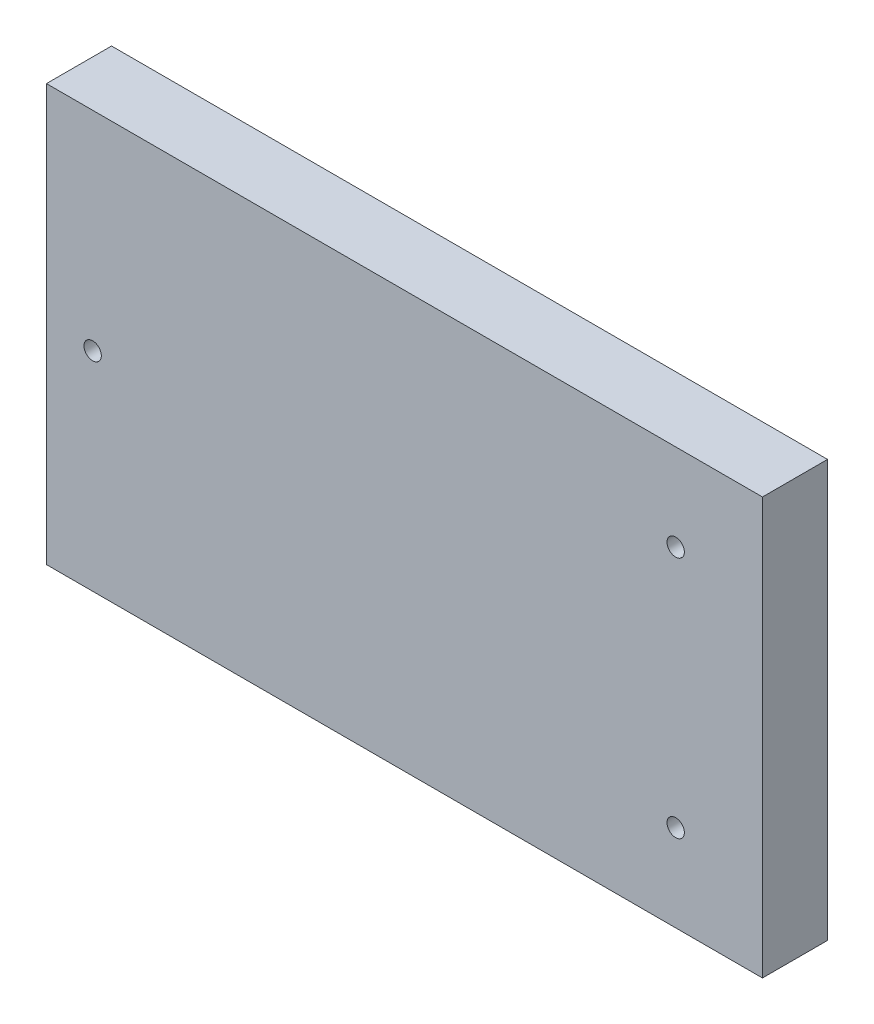
ISO-10303-21;
HEADER;
FILE_DESCRIPTION(('STEP AP214'),'2;1');
FILE_NAME('part.step','',(''),(''),'','','');
FILE_SCHEMA(('AUTOMOTIVE_DESIGN { 1 0 10303 214 1 1 1 1 }'));
ENDSEC;
DATA;
#1=APPLICATION_CONTEXT('core data for automotive mechanical design processes');
#2=APPLICATION_PROTOCOL_DEFINITION('international standard','automotive_design',2000,#1);
#3=PRODUCT_CONTEXT('',#1,'mechanical');
#4=PRODUCT('Part','Part','',(#3));
#5=PRODUCT_RELATED_PRODUCT_CATEGORY('part','',(#4));
#6=PRODUCT_DEFINITION_FORMATION('','',#4);
#7=PRODUCT_DEFINITION_CONTEXT('part definition',#1,'design');
#8=PRODUCT_DEFINITION('design','',#6,#7);
#9=PRODUCT_DEFINITION_SHAPE('','',#8);
#10=(LENGTH_UNIT() NAMED_UNIT(*) SI_UNIT(.MILLI.,.METRE.));
#11=(NAMED_UNIT(*) PLANE_ANGLE_UNIT() SI_UNIT($,.RADIAN.));
#12=(NAMED_UNIT(*) SI_UNIT($,.STERADIAN.) SOLID_ANGLE_UNIT());
#13=UNCERTAINTY_MEASURE_WITH_UNIT(LENGTH_MEASURE(1.E-05),#10,'distance_accuracy_value','');
#14=(GEOMETRIC_REPRESENTATION_CONTEXT(3) GLOBAL_UNCERTAINTY_ASSIGNED_CONTEXT((#13)) GLOBAL_UNIT_ASSIGNED_CONTEXT((#10,
#11,#12)) REPRESENTATION_CONTEXT('',''));
#15=CARTESIAN_POINT('',(0.,0.,0.));
#16=DIRECTION('',(0.,0.,1.));
#17=DIRECTION('',(1.,0.,0.));
#18=AXIS2_PLACEMENT_3D('',#15,#16,#17);
#19=CARTESIAN_POINT('',(0.,0.,15.));
#20=DIRECTION('',(0.,0.,-1.));
#21=DIRECTION('',(-1.,0.,0.));
#22=AXIS2_PLACEMENT_3D('',#19,#20,#21);
#23=PLANE('',#22);
#24=DIRECTION('',(0.,1.,0.));
#25=VECTOR('',#24,1.);
#26=CARTESIAN_POINT('',(705.534520474604,316.509389187344,15.));
#27=LINE('',#26,#25);
#28=CARTESIAN_POINT('',(705.534520474604,220.509389187344,15.));
#29=VERTEX_POINT('',#28);
#30=CARTESIAN_POINT('',(705.534520474604,316.509389187344,15.));
#31=VERTEX_POINT('',#30);
#32=EDGE_CURVE('E84',#29,#31,#27,.T.);
#33=ORIENTED_EDGE('',*,*,#32,.T.);
#34=DIRECTION('',(-1.,0.,0.));
#35=VECTOR('',#34,1.);
#36=CARTESIAN_POINT('',(705.534520474604,316.509389187344,15.));
#37=LINE('',#36,#35);
#38=CARTESIAN_POINT('',(540.534520474604,316.509389187344,15.));
#39=VERTEX_POINT('',#38);
#40=EDGE_CURVE('E79',#31,#39,#37,.T.);
#41=ORIENTED_EDGE('',*,*,#40,.T.);
#42=DIRECTION('',(0.,-1.,0.));
#43=VECTOR('',#42,1.);
#44=CARTESIAN_POINT('',(540.534520474604,316.509389187344,15.));
#45=LINE('',#44,#43);
#46=CARTESIAN_POINT('',(540.534520474604,220.509389187344,15.));
#47=VERTEX_POINT('',#46);
#48=EDGE_CURVE('E82',#39,#47,#45,.T.);
#49=ORIENTED_EDGE('',*,*,#48,.T.);
#50=DIRECTION('',(1.,0.,0.));
#51=VECTOR('',#50,1.);
#52=CARTESIAN_POINT('',(705.534520474604,220.509389187344,15.));
#53=LINE('',#52,#51);
#54=EDGE_CURVE('E49',#47,#29,#53,.T.);
#55=ORIENTED_EDGE('',*,*,#54,.T.);
#56=EDGE_LOOP('',(#33,#41,#49,#55));
#57=FACE_BOUND('',#56,.T.);
#58=CARTESIAN_POINT('',(685.534520474604,296.509389187344,15.));
#59=DIRECTION('',(0.,0.,1.));
#60=DIRECTION('',(1.,0.,0.));
#61=AXIS2_PLACEMENT_3D('',#58,#59,#60);
#62=CIRCLE('',#61,2.);
#63=CARTESIAN_POINT('',(687.534520474604,296.509389187344,15.));
#64=VERTEX_POINT('',#63);
#65=EDGE_CURVE('E99',#64,#64,#62,.T.);
#66=ORIENTED_EDGE('',*,*,#65,.F.);
#67=EDGE_LOOP('',(#66));
#68=FACE_BOUND('',#67,.T.);
#69=CARTESIAN_POINT('',(685.534520474604,240.509389187344,15.));
#70=DIRECTION('',(0.,0.,1.));
#71=DIRECTION('',(1.,0.,0.));
#72=AXIS2_PLACEMENT_3D('',#69,#70,#71);
#73=CIRCLE('',#72,2.);
#74=CARTESIAN_POINT('',(687.534520474604,240.509389187344,15.));
#75=VERTEX_POINT('',#74);
#76=EDGE_CURVE('E114',#75,#75,#73,.T.);
#77=ORIENTED_EDGE('',*,*,#76,.F.);
#78=EDGE_LOOP('',(#77));
#79=FACE_BOUND('',#78,.T.);
#80=CARTESIAN_POINT('',(551.18363111528,268.509389187344,15.));
#81=DIRECTION('',(0.,0.,1.));
#82=DIRECTION('',(1.,0.,0.));
#83=AXIS2_PLACEMENT_3D('',#80,#81,#82);
#84=CIRCLE('',#83,2.);
#85=CARTESIAN_POINT('',(553.18363111528,268.509389187344,15.));
#86=VERTEX_POINT('',#85);
#87=EDGE_CURVE('E120',#86,#86,#84,.T.);
#88=ORIENTED_EDGE('',*,*,#87,.F.);
#89=EDGE_LOOP('',(#88));
#90=FACE_BOUND('',#89,.T.);
#91=ADVANCED_FACE('F32',(#57,#68,#79,#90),#23,.F.);
#92=CARTESIAN_POINT('',(0.,0.,0.));
#93=DIRECTION('',(0.,0.,-1.));
#94=DIRECTION('',(-1.,0.,0.));
#95=AXIS2_PLACEMENT_3D('',#92,#93,#94);
#96=PLANE('',#95);
#97=CARTESIAN_POINT('',(685.534520474604,240.509389187344,0.));
#98=DIRECTION('',(0.,0.,1.));
#99=DIRECTION('',(1.,0.,0.));
#100=AXIS2_PLACEMENT_3D('',#97,#98,#99);
#101=CIRCLE('',#100,2.);
#102=CARTESIAN_POINT('',(687.534520474604,240.509389187344,0.));
#103=VERTEX_POINT('',#102);
#104=EDGE_CURVE('E117',#103,#103,#101,.T.);
#105=ORIENTED_EDGE('',*,*,#104,.T.);
#106=EDGE_LOOP('',(#105));
#107=FACE_BOUND('',#106,.T.);
#108=DIRECTION('',(0.,1.,0.));
#109=VECTOR('',#108,1.);
#110=CARTESIAN_POINT('',(705.534520474604,316.509389187344,0.));
#111=LINE('',#110,#109);
#112=CARTESIAN_POINT('',(705.534520474604,220.509389187344,0.));
#113=VERTEX_POINT('',#112);
#114=CARTESIAN_POINT('',(705.534520474604,316.509389187344,0.));
#115=VERTEX_POINT('',#114);
#116=EDGE_CURVE('E96',#113,#115,#111,.T.);
#117=ORIENTED_EDGE('',*,*,#116,.F.);
#118=DIRECTION('',(1.,0.,0.));
#119=VECTOR('',#118,1.);
#120=CARTESIAN_POINT('',(705.534520474604,220.509389187344,0.));
#121=LINE('',#120,#119);
#122=CARTESIAN_POINT('',(540.534520474604,220.509389187344,0.));
#123=VERTEX_POINT('',#122);
#124=EDGE_CURVE('E72',#123,#113,#121,.T.);
#125=ORIENTED_EDGE('',*,*,#124,.F.);
#126=DIRECTION('',(0.,-1.,0.));
#127=VECTOR('',#126,1.);
#128=CARTESIAN_POINT('',(540.534520474604,316.509389187344,0.));
#129=LINE('',#128,#127);
#130=CARTESIAN_POINT('',(540.534520474604,316.509389187344,0.));
#131=VERTEX_POINT('',#130);
#132=EDGE_CURVE('E66',#131,#123,#129,.T.);
#133=ORIENTED_EDGE('',*,*,#132,.F.);
#134=DIRECTION('',(-1.,0.,0.));
#135=VECTOR('',#134,1.);
#136=CARTESIAN_POINT('',(705.534520474604,316.509389187344,0.));
#137=LINE('',#136,#135);
#138=EDGE_CURVE('E88',#115,#131,#137,.T.);
#139=ORIENTED_EDGE('',*,*,#138,.F.);
#140=EDGE_LOOP('',(#117,#125,#133,#139));
#141=FACE_BOUND('',#140,.T.);
#142=CARTESIAN_POINT('',(685.534520474604,296.509389187344,0.));
#143=DIRECTION('',(0.,0.,1.));
#144=DIRECTION('',(1.,0.,0.));
#145=AXIS2_PLACEMENT_3D('',#142,#143,#144);
#146=CIRCLE('',#145,2.);
#147=CARTESIAN_POINT('',(687.534520474604,296.509389187344,0.));
#148=VERTEX_POINT('',#147);
#149=EDGE_CURVE('E111',#148,#148,#146,.T.);
#150=ORIENTED_EDGE('',*,*,#149,.T.);
#151=EDGE_LOOP('',(#150));
#152=FACE_BOUND('',#151,.T.);
#153=CARTESIAN_POINT('',(551.18363111528,268.509389187344,0.));
#154=DIRECTION('',(0.,0.,1.));
#155=DIRECTION('',(1.,0.,0.));
#156=AXIS2_PLACEMENT_3D('',#153,#154,#155);
#157=CIRCLE('',#156,2.);
#158=CARTESIAN_POINT('',(553.18363111528,268.509389187344,0.));
#159=VERTEX_POINT('',#158);
#160=EDGE_CURVE('E123',#159,#159,#157,.T.);
#161=ORIENTED_EDGE('',*,*,#160,.T.);
#162=EDGE_LOOP('',(#161));
#163=FACE_BOUND('',#162,.T.);
#164=ADVANCED_FACE('F107',(#107,#141,#152,#163),#96,.T.);
#165=CARTESIAN_POINT('',(705.534520474604,316.509389187344,15.));
#166=DIRECTION('',(-1.,0.,0.));
#167=DIRECTION('',(0.,0.,1.));
#168=AXIS2_PLACEMENT_3D('',#165,#166,#167);
#169=PLANE('',#168);
#170=ORIENTED_EDGE('',*,*,#116,.T.);
#171=DIRECTION('',(0.,0.,-1.));
#172=VECTOR('',#171,1.);
#173=CARTESIAN_POINT('',(705.534520474604,316.509389187344,15.));
#174=LINE('',#173,#172);
#175=EDGE_CURVE('E11',#31,#115,#174,.T.);
#176=ORIENTED_EDGE('',*,*,#175,.F.);
#177=ORIENTED_EDGE('',*,*,#32,.F.);
#178=DIRECTION('',(0.,0.,-1.));
#179=VECTOR('',#178,1.);
#180=CARTESIAN_POINT('',(705.534520474604,220.509389187344,15.));
#181=LINE('',#180,#179);
#182=EDGE_CURVE('E92',#29,#113,#181,.T.);
#183=ORIENTED_EDGE('',*,*,#182,.T.);
#184=EDGE_LOOP('',(#170,#176,#177,#183));
#185=FACE_BOUND('',#184,.T.);
#186=ADVANCED_FACE('F34',(#185),#169,.F.);
#187=CARTESIAN_POINT('',(705.534520474604,316.509389187344,15.));
#188=DIRECTION('',(0.,-1.,0.));
#189=DIRECTION('',(0.,0.,-1.));
#190=AXIS2_PLACEMENT_3D('',#187,#188,#189);
#191=PLANE('',#190);
#192=ORIENTED_EDGE('',*,*,#138,.T.);
#193=DIRECTION('',(0.,0.,-1.));
#194=VECTOR('',#193,1.);
#195=CARTESIAN_POINT('',(540.534520474604,316.509389187344,15.));
#196=LINE('',#195,#194);
#197=EDGE_CURVE('E41',#39,#131,#196,.T.);
#198=ORIENTED_EDGE('',*,*,#197,.F.);
#199=ORIENTED_EDGE('',*,*,#40,.F.);
#200=ORIENTED_EDGE('',*,*,#175,.T.);
#201=EDGE_LOOP('',(#192,#198,#199,#200));
#202=FACE_BOUND('',#201,.T.);
#203=ADVANCED_FACE('F87',(#202),#191,.F.);
#204=CARTESIAN_POINT('',(540.534520474604,316.509389187344,15.));
#205=DIRECTION('',(1.,0.,0.));
#206=DIRECTION('',(0.,0.,-1.));
#207=AXIS2_PLACEMENT_3D('',#204,#205,#206);
#208=PLANE('',#207);
#209=ORIENTED_EDGE('',*,*,#132,.T.);
#210=DIRECTION('',(0.,0.,-1.));
#211=VECTOR('',#210,1.);
#212=CARTESIAN_POINT('',(540.534520474604,220.509389187344,15.));
#213=LINE('',#212,#211);
#214=EDGE_CURVE('E89',#47,#123,#213,.T.);
#215=ORIENTED_EDGE('',*,*,#214,.F.);
#216=ORIENTED_EDGE('',*,*,#48,.F.);
#217=ORIENTED_EDGE('',*,*,#197,.T.);
#218=EDGE_LOOP('',(#209,#215,#216,#217));
#219=FACE_BOUND('',#218,.T.);
#220=ADVANCED_FACE('F90',(#219),#208,.F.);
#221=CARTESIAN_POINT('',(705.534520474604,220.509389187344,15.));
#222=DIRECTION('',(0.,1.,0.));
#223=DIRECTION('',(0.,0.,1.));
#224=AXIS2_PLACEMENT_3D('',#221,#222,#223);
#225=PLANE('',#224);
#226=ORIENTED_EDGE('',*,*,#124,.T.);
#227=ORIENTED_EDGE('',*,*,#182,.F.);
#228=ORIENTED_EDGE('',*,*,#54,.F.);
#229=ORIENTED_EDGE('',*,*,#214,.T.);
#230=EDGE_LOOP('',(#226,#227,#228,#229));
#231=FACE_BOUND('',#230,.T.);
#232=ADVANCED_FACE('F104',(#231),#225,.F.);
#233=CARTESIAN_POINT('',(685.534520474604,296.509389187344,15.));
#234=DIRECTION('',(0.,0.,-1.));
#235=DIRECTION('',(-1.,0.,0.));
#236=AXIS2_PLACEMENT_3D('',#233,#234,#235);
#237=CYLINDRICAL_SURFACE('',#236,2.);
#238=ORIENTED_EDGE('',*,*,#65,.T.);
#239=EDGE_LOOP('',(#238));
#240=FACE_BOUND('',#239,.T.);
#241=ORIENTED_EDGE('',*,*,#149,.F.);
#242=EDGE_LOOP('',(#241));
#243=FACE_BOUND('',#242,.T.);
#244=ADVANCED_FACE('F140',(#240,#243),#237,.F.);
#245=CARTESIAN_POINT('',(685.534520474604,240.509389187344,15.));
#246=DIRECTION('',(0.,0.,-1.));
#247=DIRECTION('',(-1.,0.,0.));
#248=AXIS2_PLACEMENT_3D('',#245,#246,#247);
#249=CYLINDRICAL_SURFACE('',#248,2.);
#250=ORIENTED_EDGE('',*,*,#76,.T.);
#251=EDGE_LOOP('',(#250));
#252=FACE_BOUND('',#251,.T.);
#253=ORIENTED_EDGE('',*,*,#104,.F.);
#254=EDGE_LOOP('',(#253));
#255=FACE_BOUND('',#254,.T.);
#256=ADVANCED_FACE('F186',(#252,#255),#249,.F.);
#257=CARTESIAN_POINT('',(551.18363111528,268.509389187344,15.));
#258=DIRECTION('',(0.,0.,-1.));
#259=DIRECTION('',(-1.,0.,0.));
#260=AXIS2_PLACEMENT_3D('',#257,#258,#259);
#261=CYLINDRICAL_SURFACE('',#260,2.);
#262=ORIENTED_EDGE('',*,*,#87,.T.);
#263=EDGE_LOOP('',(#262));
#264=FACE_BOUND('',#263,.T.);
#265=ORIENTED_EDGE('',*,*,#160,.F.);
#266=EDGE_LOOP('',(#265));
#267=FACE_BOUND('',#266,.T.);
#268=ADVANCED_FACE('F129',(#264,#267),#261,.F.);
#269=CLOSED_SHELL('',(#91,#164,#186,#203,#220,#232,#244,#256,#268));
#270=MANIFOLD_SOLID_BREP('B2',#269);
#271=ADVANCED_BREP_SHAPE_REPRESENTATION('',(#18,#270),#14);
#272=SHAPE_DEFINITION_REPRESENTATION(#9,#271);
ENDSEC;
END-ISO-10303-21;
